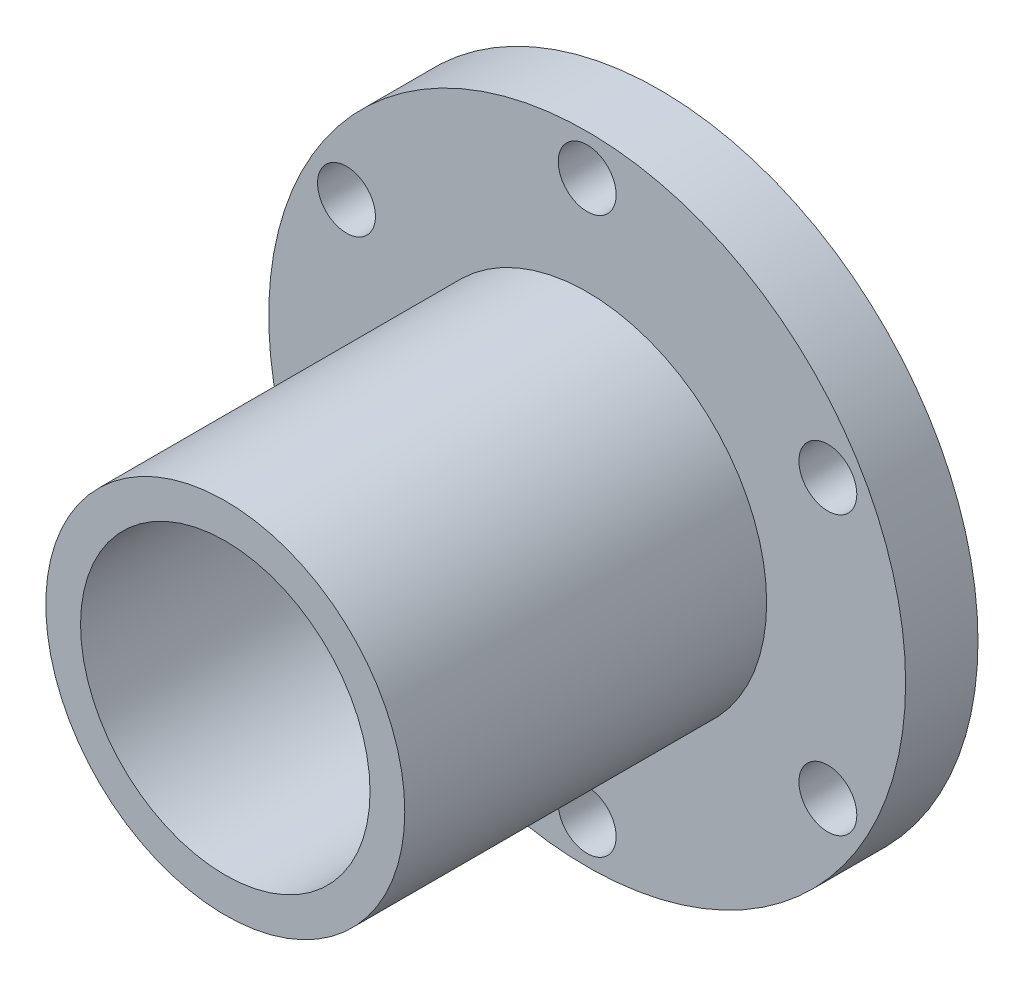
ISO-10303-21;
HEADER;
FILE_DESCRIPTION(('STEP AP214'),'2;1');
FILE_NAME('part.step','',(''),(''),'','','');
FILE_SCHEMA(('AUTOMOTIVE_DESIGN { 1 0 10303 214 1 1 1 1 }'));
ENDSEC;
DATA;
#1=APPLICATION_CONTEXT('core data for automotive mechanical design processes');
#2=APPLICATION_PROTOCOL_DEFINITION('international standard','automotive_design',2000,#1);
#3=PRODUCT_CONTEXT('',#1,'mechanical');
#4=PRODUCT('Part','Part','',(#3));
#5=PRODUCT_RELATED_PRODUCT_CATEGORY('part','',(#4));
#6=PRODUCT_DEFINITION_FORMATION('','',#4);
#7=PRODUCT_DEFINITION_CONTEXT('part definition',#1,'design');
#8=PRODUCT_DEFINITION('design','',#6,#7);
#9=PRODUCT_DEFINITION_SHAPE('','',#8);
#10=(LENGTH_UNIT() NAMED_UNIT(*) SI_UNIT(.MILLI.,.METRE.));
#11=(NAMED_UNIT(*) PLANE_ANGLE_UNIT() SI_UNIT($,.RADIAN.));
#12=(NAMED_UNIT(*) SI_UNIT($,.STERADIAN.) SOLID_ANGLE_UNIT());
#13=UNCERTAINTY_MEASURE_WITH_UNIT(LENGTH_MEASURE(1.E-05),#10,'distance_accuracy_value','');
#14=(GEOMETRIC_REPRESENTATION_CONTEXT(3) GLOBAL_UNCERTAINTY_ASSIGNED_CONTEXT((#13)) GLOBAL_UNIT_ASSIGNED_CONTEXT((#10,
#11,#12)) REPRESENTATION_CONTEXT('',''));
#15=CARTESIAN_POINT('',(0.,0.,0.));
#16=DIRECTION('',(0.,0.,1.));
#17=DIRECTION('',(1.,0.,0.));
#18=AXIS2_PLACEMENT_3D('',#15,#16,#17);
#19=CARTESIAN_POINT('',(0.,0.,25.));
#20=DIRECTION('',(0.,0.,1.));
#21=DIRECTION('',(1.,0.,0.));
#22=AXIS2_PLACEMENT_3D('',#19,#20,#21);
#23=PLANE('',#22);
#24=CARTESIAN_POINT('',(0.,0.,25.));
#25=DIRECTION('',(0.,0.,1.));
#26=DIRECTION('',(1.,0.,0.));
#27=AXIS2_PLACEMENT_3D('',#24,#25,#26);
#28=CIRCLE('',#27,62.);
#29=CARTESIAN_POINT('',(62.,0.,25.));
#30=VERTEX_POINT('',#29);
#31=EDGE_CURVE('E10',#30,#30,#28,.T.);
#32=ORIENTED_EDGE('',*,*,#31,.F.);
#33=EDGE_LOOP('',(#32));
#34=FACE_BOUND('',#33,.T.);
#35=CARTESIAN_POINT('',(83.1384387633066,47.9999999999992,25.));
#36=DIRECTION('',(0.,0.,1.));
#37=DIRECTION('',(1.,0.,0.));
#38=AXIS2_PLACEMENT_3D('',#35,#36,#37);
#39=CIRCLE('',#38,10.);
#40=CARTESIAN_POINT('',(93.1384387633066,47.9999999999992,25.));
#41=VERTEX_POINT('',#40);
#42=EDGE_CURVE('E59',#41,#41,#39,.T.);
#43=ORIENTED_EDGE('',*,*,#42,.F.);
#44=EDGE_LOOP('',(#43));
#45=FACE_BOUND('',#44,.T.);
#46=CARTESIAN_POINT('',(-83.1384387633059,48.0000000000004,25.));
#47=DIRECTION('',(0.,0.,1.));
#48=DIRECTION('',(1.,0.,0.));
#49=AXIS2_PLACEMENT_3D('',#46,#47,#48);
#50=CIRCLE('',#49,10.);
#51=CARTESIAN_POINT('',(-73.1384387633059,48.0000000000004,25.));
#52=VERTEX_POINT('',#51);
#53=EDGE_CURVE('E71',#52,#52,#50,.T.);
#54=ORIENTED_EDGE('',*,*,#53,.F.);
#55=EDGE_LOOP('',(#54));
#56=FACE_BOUND('',#55,.T.);
#57=CARTESIAN_POINT('',(0.,-96.,25.));
#58=DIRECTION('',(0.,0.,1.));
#59=DIRECTION('',(1.,0.,0.));
#60=AXIS2_PLACEMENT_3D('',#57,#58,#59);
#61=CIRCLE('',#60,10.);
#62=CARTESIAN_POINT('',(10.,-96.,25.));
#63=VERTEX_POINT('',#62);
#64=EDGE_CURVE('E83',#63,#63,#61,.T.);
#65=ORIENTED_EDGE('',*,*,#64,.F.);
#66=EDGE_LOOP('',(#65));
#67=FACE_BOUND('',#66,.T.);
#68=CARTESIAN_POINT('',(0.,0.,25.));
#69=DIRECTION('',(0.,0.,1.));
#70=DIRECTION('',(1.,0.,0.));
#71=AXIS2_PLACEMENT_3D('',#68,#69,#70);
#72=CIRCLE('',#71,110.);
#73=CARTESIAN_POINT('',(110.,0.,25.));
#74=VERTEX_POINT('',#73);
#75=EDGE_CURVE('E43',#74,#74,#72,.T.);
#76=ORIENTED_EDGE('',*,*,#75,.T.);
#77=EDGE_LOOP('',(#76));
#78=FACE_BOUND('',#77,.T.);
#79=CARTESIAN_POINT('',(-83.1384387633062,-47.9999999999998,25.));
#80=DIRECTION('',(0.,0.,1.));
#81=DIRECTION('',(1.,0.,0.));
#82=AXIS2_PLACEMENT_3D('',#79,#80,#81);
#83=CIRCLE('',#82,9.99999999999998);
#84=CARTESIAN_POINT('',(-73.1384387633062,-47.9999999999998,25.));
#85=VERTEX_POINT('',#84);
#86=EDGE_CURVE('E77',#85,#85,#83,.T.);
#87=ORIENTED_EDGE('',*,*,#86,.F.);
#88=EDGE_LOOP('',(#87));
#89=FACE_BOUND('',#88,.T.);
#90=CARTESIAN_POINT('',(6.70364417057882E-13,96.,25.));
#91=DIRECTION('',(0.,0.,1.));
#92=DIRECTION('',(1.,0.,0.));
#93=AXIS2_PLACEMENT_3D('',#90,#91,#92);
#94=CIRCLE('',#93,10.);
#95=CARTESIAN_POINT('',(10.0000000000007,96.,25.));
#96=VERTEX_POINT('',#95);
#97=EDGE_CURVE('E65',#96,#96,#94,.T.);
#98=ORIENTED_EDGE('',*,*,#97,.F.);
#99=EDGE_LOOP('',(#98));
#100=FACE_BOUND('',#99,.T.);
#101=CARTESIAN_POINT('',(83.1384387633056,-48.000000000001,25.));
#102=DIRECTION('',(0.,0.,1.));
#103=DIRECTION('',(1.,0.,0.));
#104=AXIS2_PLACEMENT_3D('',#101,#102,#103);
#105=CIRCLE('',#104,9.99999999999999);
#106=CARTESIAN_POINT('',(93.1384387633055,-48.000000000001,25.));
#107=VERTEX_POINT('',#106);
#108=EDGE_CURVE('E52',#107,#107,#105,.T.);
#109=ORIENTED_EDGE('',*,*,#108,.F.);
#110=EDGE_LOOP('',(#109));
#111=FACE_BOUND('',#110,.T.);
#112=ADVANCED_FACE('F35',(#34,#45,#56,#67,#78,#89,#100,#111),#23,.T.);
#113=CARTESIAN_POINT('',(0.,0.,0.));
#114=DIRECTION('',(0.,0.,1.));
#115=DIRECTION('',(1.,0.,0.));
#116=AXIS2_PLACEMENT_3D('',#113,#114,#115);
#117=PLANE('',#116);
#118=CARTESIAN_POINT('',(0.,0.,0.));
#119=DIRECTION('',(0.,0.,1.));
#120=DIRECTION('',(1.,0.,0.));
#121=AXIS2_PLACEMENT_3D('',#118,#119,#120);
#122=CIRCLE('',#121,50.);
#123=CARTESIAN_POINT('',(50.,0.,0.));
#124=VERTEX_POINT('',#123);
#125=EDGE_CURVE('E260',#124,#124,#122,.T.);
#126=ORIENTED_EDGE('',*,*,#125,.T.);
#127=EDGE_LOOP('',(#126));
#128=FACE_BOUND('',#127,.T.);
#129=CARTESIAN_POINT('',(0.,0.,0.));
#130=DIRECTION('',(0.,0.,1.));
#131=DIRECTION('',(1.,0.,0.));
#132=AXIS2_PLACEMENT_3D('',#129,#130,#131);
#133=CIRCLE('',#132,110.);
#134=CARTESIAN_POINT('',(110.,0.,0.));
#135=VERTEX_POINT('',#134);
#136=EDGE_CURVE('E39',#135,#135,#133,.T.);
#137=ORIENTED_EDGE('',*,*,#136,.F.);
#138=EDGE_LOOP('',(#137));
#139=FACE_BOUND('',#138,.T.);
#140=CARTESIAN_POINT('',(0.,-96.,0.));
#141=DIRECTION('',(0.,0.,1.));
#142=DIRECTION('',(1.,0.,0.));
#143=AXIS2_PLACEMENT_3D('',#140,#141,#142);
#144=CIRCLE('',#143,10.);
#145=CARTESIAN_POINT('',(10.,-96.,0.));
#146=VERTEX_POINT('',#145);
#147=EDGE_CURVE('E80',#146,#146,#144,.T.);
#148=ORIENTED_EDGE('',*,*,#147,.T.);
#149=EDGE_LOOP('',(#148));
#150=FACE_BOUND('',#149,.T.);
#151=CARTESIAN_POINT('',(-83.1384387633062,-47.9999999999998,0.));
#152=DIRECTION('',(0.,0.,1.));
#153=DIRECTION('',(1.,0.,0.));
#154=AXIS2_PLACEMENT_3D('',#151,#152,#153);
#155=CIRCLE('',#154,9.99999999999998);
#156=CARTESIAN_POINT('',(-73.1384387633062,-47.9999999999998,0.));
#157=VERTEX_POINT('',#156);
#158=EDGE_CURVE('E74',#157,#157,#155,.T.);
#159=ORIENTED_EDGE('',*,*,#158,.T.);
#160=EDGE_LOOP('',(#159));
#161=FACE_BOUND('',#160,.T.);
#162=CARTESIAN_POINT('',(-83.1384387633059,48.0000000000004,0.));
#163=DIRECTION('',(0.,0.,1.));
#164=DIRECTION('',(1.,0.,0.));
#165=AXIS2_PLACEMENT_3D('',#162,#163,#164);
#166=CIRCLE('',#165,10.);
#167=CARTESIAN_POINT('',(-73.1384387633059,48.0000000000004,0.));
#168=VERTEX_POINT('',#167);
#169=EDGE_CURVE('E68',#168,#168,#166,.T.);
#170=ORIENTED_EDGE('',*,*,#169,.T.);
#171=EDGE_LOOP('',(#170));
#172=FACE_BOUND('',#171,.T.);
#173=CARTESIAN_POINT('',(6.70364417057882E-13,96.,0.));
#174=DIRECTION('',(0.,0.,1.));
#175=DIRECTION('',(1.,0.,0.));
#176=AXIS2_PLACEMENT_3D('',#173,#174,#175);
#177=CIRCLE('',#176,10.);
#178=CARTESIAN_POINT('',(10.0000000000007,96.,0.));
#179=VERTEX_POINT('',#178);
#180=EDGE_CURVE('E62',#179,#179,#177,.T.);
#181=ORIENTED_EDGE('',*,*,#180,.T.);
#182=EDGE_LOOP('',(#181));
#183=FACE_BOUND('',#182,.T.);
#184=CARTESIAN_POINT('',(83.1384387633066,47.9999999999992,0.));
#185=DIRECTION('',(0.,0.,1.));
#186=DIRECTION('',(1.,0.,0.));
#187=AXIS2_PLACEMENT_3D('',#184,#185,#186);
#188=CIRCLE('',#187,10.);
#189=CARTESIAN_POINT('',(93.1384387633066,47.9999999999992,0.));
#190=VERTEX_POINT('',#189);
#191=EDGE_CURVE('E55',#190,#190,#188,.T.);
#192=ORIENTED_EDGE('',*,*,#191,.T.);
#193=EDGE_LOOP('',(#192));
#194=FACE_BOUND('',#193,.T.);
#195=CARTESIAN_POINT('',(83.1384387633056,-48.000000000001,0.));
#196=DIRECTION('',(0.,0.,1.));
#197=DIRECTION('',(1.,0.,0.));
#198=AXIS2_PLACEMENT_3D('',#195,#196,#197);
#199=CIRCLE('',#198,9.99999999999999);
#200=CARTESIAN_POINT('',(93.1384387633055,-48.000000000001,0.));
#201=VERTEX_POINT('',#200);
#202=EDGE_CURVE('E56',#201,#201,#199,.T.);
#203=ORIENTED_EDGE('',*,*,#202,.T.);
#204=EDGE_LOOP('',(#203));
#205=FACE_BOUND('',#204,.T.);
#206=ADVANCED_FACE('F89',(#128,#139,#150,#161,#172,#183,#194,#205),#117,.F.);
#207=CARTESIAN_POINT('',(0.,0.,25.));
#208=DIRECTION('',(0.,0.,-1.));
#209=DIRECTION('',(-1.,0.,0.));
#210=AXIS2_PLACEMENT_3D('',#207,#208,#209);
#211=CYLINDRICAL_SURFACE('',#210,110.);
#212=ORIENTED_EDGE('',*,*,#75,.F.);
#213=EDGE_LOOP('',(#212));
#214=FACE_BOUND('',#213,.T.);
#215=ORIENTED_EDGE('',*,*,#136,.T.);
#216=EDGE_LOOP('',(#215));
#217=FACE_BOUND('',#216,.T.);
#218=ADVANCED_FACE('F37',(#214,#217),#211,.T.);
#219=CARTESIAN_POINT('',(0.,-96.,25.));
#220=DIRECTION('',(0.,0.,-1.));
#221=DIRECTION('',(-1.,0.,0.));
#222=AXIS2_PLACEMENT_3D('',#219,#220,#221);
#223=CYLINDRICAL_SURFACE('',#222,10.);
#224=ORIENTED_EDGE('',*,*,#64,.T.);
#225=EDGE_LOOP('',(#224));
#226=FACE_BOUND('',#225,.T.);
#227=ORIENTED_EDGE('',*,*,#147,.F.);
#228=EDGE_LOOP('',(#227));
#229=FACE_BOUND('',#228,.T.);
#230=ADVANCED_FACE('F92',(#226,#229),#223,.F.);
#231=CARTESIAN_POINT('',(-83.1384387633062,-47.9999999999998,25.));
#232=DIRECTION('',(0.,0.,-1.));
#233=DIRECTION('',(-1.,0.,0.));
#234=AXIS2_PLACEMENT_3D('',#231,#232,#233);
#235=CYLINDRICAL_SURFACE('',#234,9.99999999999998);
#236=ORIENTED_EDGE('',*,*,#86,.T.);
#237=EDGE_LOOP('',(#236));
#238=FACE_BOUND('',#237,.T.);
#239=ORIENTED_EDGE('',*,*,#158,.F.);
#240=EDGE_LOOP('',(#239));
#241=FACE_BOUND('',#240,.T.);
#242=ADVANCED_FACE('F94',(#238,#241),#235,.F.);
#243=CARTESIAN_POINT('',(-83.1384387633059,48.0000000000004,25.));
#244=DIRECTION('',(0.,0.,-1.));
#245=DIRECTION('',(-1.,0.,0.));
#246=AXIS2_PLACEMENT_3D('',#243,#244,#245);
#247=CYLINDRICAL_SURFACE('',#246,10.);
#248=ORIENTED_EDGE('',*,*,#53,.T.);
#249=EDGE_LOOP('',(#248));
#250=FACE_BOUND('',#249,.T.);
#251=ORIENTED_EDGE('',*,*,#169,.F.);
#252=EDGE_LOOP('',(#251));
#253=FACE_BOUND('',#252,.T.);
#254=ADVANCED_FACE('F101',(#250,#253),#247,.F.);
#255=CARTESIAN_POINT('',(6.70364417057882E-13,96.,25.));
#256=DIRECTION('',(0.,0.,-1.));
#257=DIRECTION('',(-1.,0.,0.));
#258=AXIS2_PLACEMENT_3D('',#255,#256,#257);
#259=CYLINDRICAL_SURFACE('',#258,10.);
#260=ORIENTED_EDGE('',*,*,#97,.T.);
#261=EDGE_LOOP('',(#260));
#262=FACE_BOUND('',#261,.T.);
#263=ORIENTED_EDGE('',*,*,#180,.F.);
#264=EDGE_LOOP('',(#263));
#265=FACE_BOUND('',#264,.T.);
#266=ADVANCED_FACE('F142',(#262,#265),#259,.F.);
#267=CARTESIAN_POINT('',(83.1384387633066,47.9999999999992,25.));
#268=DIRECTION('',(0.,0.,-1.));
#269=DIRECTION('',(-1.,0.,0.));
#270=AXIS2_PLACEMENT_3D('',#267,#268,#269);
#271=CYLINDRICAL_SURFACE('',#270,10.);
#272=ORIENTED_EDGE('',*,*,#42,.T.);
#273=EDGE_LOOP('',(#272));
#274=FACE_BOUND('',#273,.T.);
#275=ORIENTED_EDGE('',*,*,#191,.F.);
#276=EDGE_LOOP('',(#275));
#277=FACE_BOUND('',#276,.T.);
#278=ADVANCED_FACE('F131',(#274,#277),#271,.F.);
#279=CARTESIAN_POINT('',(83.1384387633056,-48.000000000001,25.));
#280=DIRECTION('',(0.,0.,-1.));
#281=DIRECTION('',(-1.,0.,0.));
#282=AXIS2_PLACEMENT_3D('',#279,#280,#281);
#283=CYLINDRICAL_SURFACE('',#282,9.99999999999999);
#284=ORIENTED_EDGE('',*,*,#108,.T.);
#285=EDGE_LOOP('',(#284));
#286=FACE_BOUND('',#285,.T.);
#287=ORIENTED_EDGE('',*,*,#202,.F.);
#288=EDGE_LOOP('',(#287));
#289=FACE_BOUND('',#288,.T.);
#290=ADVANCED_FACE('F127',(#286,#289),#283,.F.);
#291=CARTESIAN_POINT('',(0.,0.,150.));
#292=DIRECTION('',(0.,0.,-1.));
#293=DIRECTION('',(-1.,0.,0.));
#294=AXIS2_PLACEMENT_3D('',#291,#292,#293);
#295=CYLINDRICAL_SURFACE('',#294,62.);
#296=CARTESIAN_POINT('',(0.,0.,150.));
#297=DIRECTION('',(0.,0.,1.));
#298=DIRECTION('',(1.,0.,0.));
#299=AXIS2_PLACEMENT_3D('',#296,#297,#298);
#300=CIRCLE('',#299,62.);
#301=CARTESIAN_POINT('',(62.,0.,150.));
#302=VERTEX_POINT('',#301);
#303=EDGE_CURVE('E50',#302,#302,#300,.T.);
#304=ORIENTED_EDGE('',*,*,#303,.F.);
#305=EDGE_LOOP('',(#304));
#306=FACE_BOUND('',#305,.T.);
#307=ORIENTED_EDGE('',*,*,#31,.T.);
#308=EDGE_LOOP('',(#307));
#309=FACE_BOUND('',#308,.T.);
#310=ADVANCED_FACE('F130',(#306,#309),#295,.T.);
#311=CARTESIAN_POINT('',(0.,0.,150.));
#312=DIRECTION('',(0.,0.,1.));
#313=DIRECTION('',(1.,0.,0.));
#314=AXIS2_PLACEMENT_3D('',#311,#312,#313);
#315=PLANE('',#314);
#316=CARTESIAN_POINT('',(0.,0.,150.));
#317=DIRECTION('',(0.,0.,1.));
#318=DIRECTION('',(1.,0.,0.));
#319=AXIS2_PLACEMENT_3D('',#316,#317,#318);
#320=CIRCLE('',#319,50.);
#321=CARTESIAN_POINT('',(50.,0.,150.));
#322=VERTEX_POINT('',#321);
#323=EDGE_CURVE('E263',#322,#322,#320,.T.);
#324=ORIENTED_EDGE('',*,*,#323,.F.);
#325=EDGE_LOOP('',(#324));
#326=FACE_BOUND('',#325,.T.);
#327=ORIENTED_EDGE('',*,*,#303,.T.);
#328=EDGE_LOOP('',(#327));
#329=FACE_BOUND('',#328,.T.);
#330=ADVANCED_FACE('F139',(#326,#329),#315,.T.);
#331=CARTESIAN_POINT('',(0.,0.,0.));
#332=DIRECTION('',(0.,0.,1.));
#333=DIRECTION('',(1.,0.,0.));
#334=AXIS2_PLACEMENT_3D('',#331,#332,#333);
#335=CYLINDRICAL_SURFACE('',#334,50.);
#336=ORIENTED_EDGE('',*,*,#125,.F.);
#337=EDGE_LOOP('',(#336));
#338=FACE_BOUND('',#337,.T.);
#339=ORIENTED_EDGE('',*,*,#323,.T.);
#340=EDGE_LOOP('',(#339));
#341=FACE_BOUND('',#340,.T.);
#342=ADVANCED_FACE('F208',(#338,#341),#335,.F.);
#343=CLOSED_SHELL('',(#112,#206,#218,#230,#242,#254,#266,#278,#290,#310,#330,#342));
#344=MANIFOLD_SOLID_BREP('B2',#343);
#345=ADVANCED_BREP_SHAPE_REPRESENTATION('',(#18,#344),#14);
#346=SHAPE_DEFINITION_REPRESENTATION(#9,#345);
ENDSEC;
END-ISO-10303-21;
